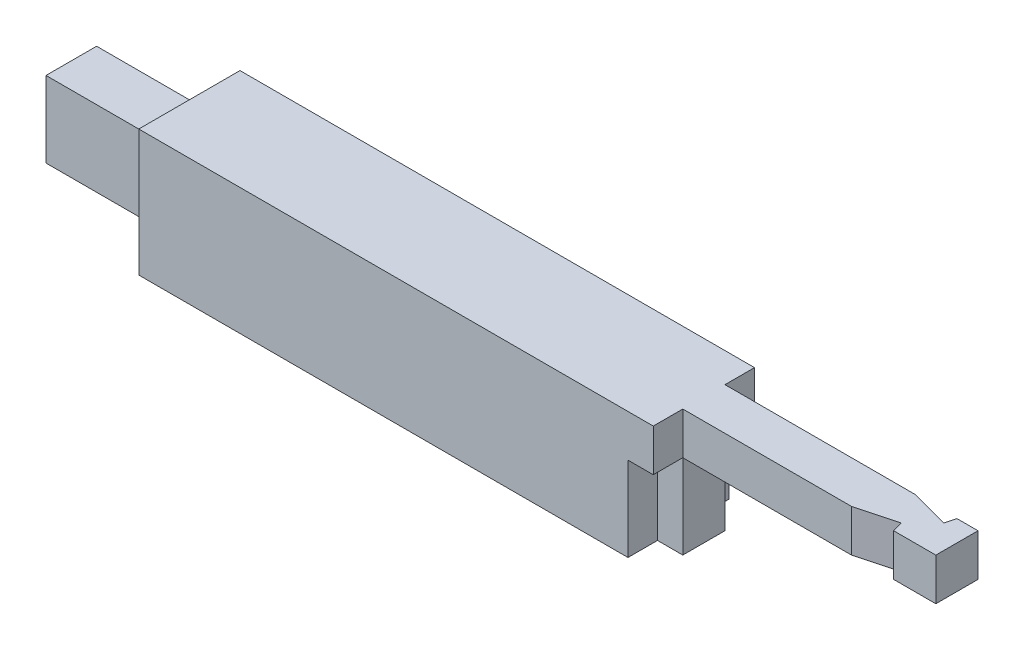
ISO-10303-21;
HEADER;
FILE_DESCRIPTION(('STEP AP214'),'2;1');
FILE_NAME('part.step','',(''),(''),'','','');
FILE_SCHEMA(('AUTOMOTIVE_DESIGN { 1 0 10303 214 1 1 1 1 }'));
ENDSEC;
DATA;
#1=APPLICATION_CONTEXT('core data for automotive mechanical design processes');
#2=APPLICATION_PROTOCOL_DEFINITION('international standard','automotive_design',2000,#1);
#3=PRODUCT_CONTEXT('',#1,'mechanical');
#4=PRODUCT('Part','Part','',(#3));
#5=PRODUCT_RELATED_PRODUCT_CATEGORY('part','',(#4));
#6=PRODUCT_DEFINITION_FORMATION('','',#4);
#7=PRODUCT_DEFINITION_CONTEXT('part definition',#1,'design');
#8=PRODUCT_DEFINITION('design','',#6,#7);
#9=PRODUCT_DEFINITION_SHAPE('','',#8);
#10=(LENGTH_UNIT() NAMED_UNIT(*) SI_UNIT(.MILLI.,.METRE.));
#11=(NAMED_UNIT(*) PLANE_ANGLE_UNIT() SI_UNIT($,.RADIAN.));
#12=(NAMED_UNIT(*) SI_UNIT($,.STERADIAN.) SOLID_ANGLE_UNIT());
#13=UNCERTAINTY_MEASURE_WITH_UNIT(LENGTH_MEASURE(1.E-05),#10,'distance_accuracy_value','');
#14=(GEOMETRIC_REPRESENTATION_CONTEXT(3) GLOBAL_UNCERTAINTY_ASSIGNED_CONTEXT((#13)) GLOBAL_UNIT_ASSIGNED_CONTEXT((#10,
#11,#12)) REPRESENTATION_CONTEXT('',''));
#15=CARTESIAN_POINT('',(0.,0.,0.));
#16=DIRECTION('',(0.,0.,1.));
#17=DIRECTION('',(1.,0.,0.));
#18=AXIS2_PLACEMENT_3D('',#15,#16,#17);
#19=CARTESIAN_POINT('',(610.,150.,0.));
#20=DIRECTION('',(0.,-1.,0.));
#21=DIRECTION('',(0.,0.,-1.));
#22=AXIS2_PLACEMENT_3D('',#19,#20,#21);
#23=PLANE('',#22);
#24=DIRECTION('',(-1.,0.,0.));
#25=VECTOR('',#24,1.);
#26=CARTESIAN_POINT('',(910.,150.,-35.));
#27=LINE('',#26,#25);
#28=CARTESIAN_POINT('',(810.,150.,-35.));
#29=VERTEX_POINT('',#28);
#30=CARTESIAN_POINT('',(610.,150.,-35.));
#31=VERTEX_POINT('',#30);
#32=EDGE_CURVE('E213',#29,#31,#27,.T.);
#33=ORIENTED_EDGE('',*,*,#32,.F.);
#34=DIRECTION('',(-0.965925826289068,0.,0.258819045102522));
#35=VECTOR('',#34,1.);
#36=CARTESIAN_POINT('',(45.5097114673026,150.,169.844555433773));
#37=LINE('',#36,#35);
#38=CARTESIAN_POINT('',(856.650635094611,150.,-47.4999999999999));
#39=VERTEX_POINT('',#38);
#40=EDGE_CURVE('E199',#39,#29,#37,.T.);
#41=ORIENTED_EDGE('',*,*,#40,.F.);
#42=DIRECTION('',(-0.258819045102522,0.,-0.965925826289068));
#43=VECTOR('',#42,1.);
#44=CARTESIAN_POINT('',(811.140923627308,150.,-217.344555433773));
#45=LINE('',#44,#43);
#46=CARTESIAN_POINT('',(860.,150.,-35.));
#47=VERTEX_POINT('',#46);
#48=EDGE_CURVE('E192',#47,#39,#45,.T.);
#49=ORIENTED_EDGE('',*,*,#48,.F.);
#50=CARTESIAN_POINT('',(910.,150.,-35.));
#51=VERTEX_POINT('',#50);
#52=EDGE_CURVE('E205',#51,#47,#27,.T.);
#53=ORIENTED_EDGE('',*,*,#52,.F.);
#54=DIRECTION('',(0.,0.,1.));
#55=VECTOR('',#54,1.);
#56=CARTESIAN_POINT('',(910.,150.,-35.));
#57=LINE('',#56,#55);
#58=CARTESIAN_POINT('',(910.,150.,-85.));
#59=VERTEX_POINT('',#58);
#60=EDGE_CURVE('E217',#59,#51,#57,.T.);
#61=ORIENTED_EDGE('',*,*,#60,.F.);
#62=DIRECTION('',(-1.,0.,0.));
#63=VECTOR('',#62,1.);
#64=CARTESIAN_POINT('',(910.,150.,-85.));
#65=LINE('',#64,#63);
#66=CARTESIAN_POINT('',(885.,150.,-85.));
#67=VERTEX_POINT('',#66);
#68=EDGE_CURVE('E215',#59,#67,#65,.T.);
#69=ORIENTED_EDGE('',*,*,#68,.T.);
#70=DIRECTION('',(-0.258819045102514,0.,0.96592582628907));
#71=VECTOR('',#70,1.);
#72=CARTESIAN_POINT('',(804.466241174617,150.,215.556079660833));
#73=LINE('',#72,#71);
#74=CARTESIAN_POINT('',(881.650635094611,150.,-72.5));
#75=VERTEX_POINT('',#74);
#76=EDGE_CURVE('E59',#67,#75,#73,.T.);
#77=ORIENTED_EDGE('',*,*,#76,.T.);
#78=DIRECTION('',(-0.965925826289068,0.,-0.258819045102521));
#79=VECTOR('',#78,1.);
#80=CARTESIAN_POINT('',(77.184393919997,150.,-288.056079660839));
#81=LINE('',#80,#79);
#82=CARTESIAN_POINT('',(835.,150.,-85.));
#83=VERTEX_POINT('',#82);
#84=EDGE_CURVE('E457',#75,#83,#81,.T.);
#85=ORIENTED_EDGE('',*,*,#84,.T.);
#86=CARTESIAN_POINT('',(610.,150.,-85.));
#87=VERTEX_POINT('',#86);
#88=EDGE_CURVE('E212',#83,#87,#65,.T.);
#89=ORIENTED_EDGE('',*,*,#88,.T.);
#90=DIRECTION('',(0.,0.,1.));
#91=VECTOR('',#90,1.);
#92=CARTESIAN_POINT('',(610.,150.,0.));
#93=LINE('',#92,#91);
#94=CARTESIAN_POINT('',(610.,150.,-120.));
#95=VERTEX_POINT('',#94);
#96=EDGE_CURVE('E241',#95,#87,#93,.T.);
#97=ORIENTED_EDGE('',*,*,#96,.F.);
#98=DIRECTION('',(-1.,0.,0.));
#99=VECTOR('',#98,1.);
#100=CARTESIAN_POINT('',(610.,150.,-120.));
#101=LINE('',#100,#99);
#102=CARTESIAN_POINT('',(0.,150.,-120.));
#103=VERTEX_POINT('',#102);
#104=EDGE_CURVE('E255',#95,#103,#101,.T.);
#105=ORIENTED_EDGE('',*,*,#104,.T.);
#106=DIRECTION('',(0.,0.,1.));
#107=VECTOR('',#106,1.);
#108=CARTESIAN_POINT('',(0.,150.,0.));
#109=LINE('',#108,#107);
#110=CARTESIAN_POINT('',(0.,150.,0.));
#111=VERTEX_POINT('',#110);
#112=EDGE_CURVE('E235',#103,#111,#109,.T.);
#113=ORIENTED_EDGE('',*,*,#112,.T.);
#114=DIRECTION('',(-1.,0.,0.));
#115=VECTOR('',#114,1.);
#116=CARTESIAN_POINT('',(610.,150.,0.));
#117=LINE('',#116,#115);
#118=CARTESIAN_POINT('',(610.,150.,0.));
#119=VERTEX_POINT('',#118);
#120=EDGE_CURVE('E244',#119,#111,#117,.T.);
#121=ORIENTED_EDGE('',*,*,#120,.F.);
#122=EDGE_CURVE('E240',#31,#119,#93,.T.);
#123=ORIENTED_EDGE('',*,*,#122,.F.);
#124=EDGE_LOOP('',(#33,#41,#49,#53,#61,#69,#77,#85,#89,#97,#105,#113,#121,#123));
#125=FACE_BOUND('',#124,.T.);
#126=ADVANCED_FACE('F36',(#125),#23,.F.);
#127=CARTESIAN_POINT('',(910.,150.,-35.));
#128=DIRECTION('',(0.,0.,-1.));
#129=DIRECTION('',(-1.,0.,0.));
#130=AXIS2_PLACEMENT_3D('',#127,#128,#129);
#131=PLANE('',#130);
#132=DIRECTION('',(-1.,0.,0.));
#133=VECTOR('',#132,1.);
#134=CARTESIAN_POINT('',(910.,100.,-35.));
#135=LINE('',#134,#133);
#136=CARTESIAN_POINT('',(810.,100.,-35.));
#137=VERTEX_POINT('',#136);
#138=CARTESIAN_POINT('',(610.,100.,-35.));
#139=VERTEX_POINT('',#138);
#140=EDGE_CURVE('E227',#137,#139,#135,.T.);
#141=ORIENTED_EDGE('',*,*,#140,.F.);
#142=DIRECTION('',(0.,1.,0.));
#143=VECTOR('',#142,1.);
#144=CARTESIAN_POINT('',(810.,0.,-35.));
#145=LINE('',#144,#143);
#146=EDGE_CURVE('E465',#137,#29,#145,.T.);
#147=ORIENTED_EDGE('',*,*,#146,.T.);
#148=ORIENTED_EDGE('',*,*,#32,.T.);
#149=DIRECTION('',(0.,-1.,0.));
#150=VECTOR('',#149,1.);
#151=CARTESIAN_POINT('',(610.,150.,-35.));
#152=LINE('',#151,#150);
#153=EDGE_CURVE('E285',#31,#139,#152,.T.);
#154=ORIENTED_EDGE('',*,*,#153,.T.);
#155=EDGE_LOOP('',(#141,#147,#148,#154));
#156=FACE_BOUND('',#155,.T.);
#157=ADVANCED_FACE('F303',(#156),#131,.F.);
#158=CARTESIAN_POINT('',(910.,100.,-35.));
#159=DIRECTION('',(0.,1.,0.));
#160=DIRECTION('',(0.,0.,1.));
#161=AXIS2_PLACEMENT_3D('',#158,#159,#160);
#162=PLANE('',#161);
#163=DIRECTION('',(-0.258819045102522,0.,-0.965925826289068));
#164=VECTOR('',#163,1.);
#165=CARTESIAN_POINT('',(863.349364905389,100.,-22.4999999999999));
#166=LINE('',#165,#164);
#167=CARTESIAN_POINT('',(860.,100.,-35.));
#168=VERTEX_POINT('',#167);
#169=CARTESIAN_POINT('',(856.650635094611,100.,-47.4999999999999));
#170=VERTEX_POINT('',#169);
#171=EDGE_CURVE('E44',#168,#170,#166,.T.);
#172=ORIENTED_EDGE('',*,*,#171,.T.);
#173=DIRECTION('',(-0.965925826289068,0.,0.258819045102522));
#174=VECTOR('',#173,1.);
#175=CARTESIAN_POINT('',(903.301270189222,100.,-60.0000000000001));
#176=LINE('',#175,#174);
#177=EDGE_CURVE('E11',#170,#137,#176,.T.);
#178=ORIENTED_EDGE('',*,*,#177,.T.);
#179=ORIENTED_EDGE('',*,*,#140,.T.);
#180=DIRECTION('',(0.,0.,-1.));
#181=VECTOR('',#180,1.);
#182=CARTESIAN_POINT('',(610.,100.,-35.));
#183=LINE('',#182,#181);
#184=CARTESIAN_POINT('',(610.,100.,-85.));
#185=VERTEX_POINT('',#184);
#186=EDGE_CURVE('E278',#139,#185,#183,.T.);
#187=ORIENTED_EDGE('',*,*,#186,.T.);
#188=DIRECTION('',(-1.,0.,0.));
#189=VECTOR('',#188,1.);
#190=CARTESIAN_POINT('',(910.,100.,-85.));
#191=LINE('',#190,#189);
#192=CARTESIAN_POINT('',(835.,100.,-85.));
#193=VERTEX_POINT('',#192);
#194=EDGE_CURVE('E223',#193,#185,#191,.T.);
#195=ORIENTED_EDGE('',*,*,#194,.F.);
#196=DIRECTION('',(-0.965925826289068,0.,-0.258819045102521));
#197=VECTOR('',#196,1.);
#198=CARTESIAN_POINT('',(917.475952641916,100.,-62.9006350946109));
#199=LINE('',#198,#197);
#200=CARTESIAN_POINT('',(881.650635094611,100.,-72.5));
#201=VERTEX_POINT('',#200);
#202=EDGE_CURVE('E345',#201,#193,#199,.T.);
#203=ORIENTED_EDGE('',*,*,#202,.F.);
#204=DIRECTION('',(-0.258819045102514,0.,0.96592582628907));
#205=VECTOR('',#204,1.);
#206=CARTESIAN_POINT('',(874.174682452694,100.,-44.5993649053888));
#207=LINE('',#206,#205);
#208=CARTESIAN_POINT('',(885.,100.,-85.));
#209=VERTEX_POINT('',#208);
#210=EDGE_CURVE('E463',#209,#201,#207,.T.);
#211=ORIENTED_EDGE('',*,*,#210,.F.);
#212=CARTESIAN_POINT('',(910.,100.,-85.));
#213=VERTEX_POINT('',#212);
#214=EDGE_CURVE('E224',#213,#209,#191,.T.);
#215=ORIENTED_EDGE('',*,*,#214,.F.);
#216=DIRECTION('',(0.,0.,-1.));
#217=VECTOR('',#216,1.);
#218=CARTESIAN_POINT('',(910.,100.,-35.));
#219=LINE('',#218,#217);
#220=CARTESIAN_POINT('',(910.,100.,-35.));
#221=VERTEX_POINT('',#220);
#222=EDGE_CURVE('E269',#221,#213,#219,.T.);
#223=ORIENTED_EDGE('',*,*,#222,.F.);
#224=EDGE_CURVE('E228',#221,#168,#135,.T.);
#225=ORIENTED_EDGE('',*,*,#224,.T.);
#226=EDGE_LOOP('',(#172,#178,#179,#187,#195,#203,#211,#215,#223,#225));
#227=FACE_BOUND('',#226,.T.);
#228=ADVANCED_FACE('F266',(#227),#162,.F.);
#229=CARTESIAN_POINT('',(910.,150.,-85.));
#230=DIRECTION('',(0.,0.,1.));
#231=DIRECTION('',(1.,0.,0.));
#232=AXIS2_PLACEMENT_3D('',#229,#230,#231);
#233=PLANE('',#232);
#234=DIRECTION('',(0.,1.,0.));
#235=VECTOR('',#234,1.);
#236=CARTESIAN_POINT('',(835.,150.,-85.));
#237=LINE('',#236,#235);
#238=EDGE_CURVE('E264',#193,#83,#237,.T.);
#239=ORIENTED_EDGE('',*,*,#238,.F.);
#240=ORIENTED_EDGE('',*,*,#194,.T.);
#241=DIRECTION('',(0.,1.,0.));
#242=VECTOR('',#241,1.);
#243=CARTESIAN_POINT('',(610.,150.,-85.));
#244=LINE('',#243,#242);
#245=EDGE_CURVE('E219',#185,#87,#244,.T.);
#246=ORIENTED_EDGE('',*,*,#245,.T.);
#247=ORIENTED_EDGE('',*,*,#88,.F.);
#248=EDGE_LOOP('',(#239,#240,#246,#247));
#249=FACE_BOUND('',#248,.T.);
#250=ADVANCED_FACE('F451',(#249),#233,.F.);
#251=DIRECTION('',(0.,-1.,0.));
#252=VECTOR('',#251,1.);
#253=CARTESIAN_POINT('',(885.,150.,-85.));
#254=LINE('',#253,#252);
#255=EDGE_CURVE('E262',#67,#209,#254,.T.);
#256=ORIENTED_EDGE('',*,*,#255,.F.);
#257=ORIENTED_EDGE('',*,*,#68,.F.);
#258=DIRECTION('',(0.,1.,0.));
#259=VECTOR('',#258,1.);
#260=CARTESIAN_POINT('',(910.,150.,-85.));
#261=LINE('',#260,#259);
#262=EDGE_CURVE('E273',#213,#59,#261,.T.);
#263=ORIENTED_EDGE('',*,*,#262,.F.);
#264=ORIENTED_EDGE('',*,*,#214,.T.);
#265=EDGE_LOOP('',(#256,#257,#263,#264));
#266=FACE_BOUND('',#265,.T.);
#267=ADVANCED_FACE('F491',(#266),#233,.F.);
#268=CARTESIAN_POINT('',(610.,0.,0.));
#269=DIRECTION('',(-1.,0.,0.));
#270=DIRECTION('',(0.,0.,1.));
#271=AXIS2_PLACEMENT_3D('',#268,#269,#270);
#272=PLANE('',#271);
#273=ORIENTED_EDGE('',*,*,#186,.F.);
#274=DIRECTION('',(0.,1.,0.));
#275=VECTOR('',#274,1.);
#276=CARTESIAN_POINT('',(610.,100.,-35.));
#277=LINE('',#276,#275);
#278=CARTESIAN_POINT('',(610.,0.,-35.));
#279=VERTEX_POINT('',#278);
#280=EDGE_CURVE('E297',#279,#139,#277,.T.);
#281=ORIENTED_EDGE('',*,*,#280,.F.);
#282=DIRECTION('',(0.,0.,-1.));
#283=VECTOR('',#282,1.);
#284=CARTESIAN_POINT('',(610.,0.,0.));
#285=LINE('',#284,#283);
#286=CARTESIAN_POINT('',(610.,0.,-85.));
#287=VERTEX_POINT('',#286);
#288=EDGE_CURVE('E234',#279,#287,#285,.T.);
#289=ORIENTED_EDGE('',*,*,#288,.T.);
#290=DIRECTION('',(0.,-1.,0.));
#291=VECTOR('',#290,1.);
#292=CARTESIAN_POINT('',(610.,100.,-85.));
#293=LINE('',#292,#291);
#294=EDGE_CURVE('E299',#185,#287,#293,.T.);
#295=ORIENTED_EDGE('',*,*,#294,.F.);
#296=EDGE_LOOP('',(#273,#281,#289,#295));
#297=FACE_BOUND('',#296,.T.);
#298=ADVANCED_FACE('F295',(#297),#272,.F.);
#299=DIRECTION('',(0.,-1.,0.));
#300=VECTOR('',#299,1.);
#301=CARTESIAN_POINT('',(610.,0.,0.));
#302=LINE('',#301,#300);
#303=CARTESIAN_POINT('',(610.,100.,0.));
#304=VERTEX_POINT('',#303);
#305=EDGE_CURVE('E231',#119,#304,#302,.T.);
#306=ORIENTED_EDGE('',*,*,#305,.T.);
#307=DIRECTION('',(0.,0.,1.));
#308=VECTOR('',#307,1.);
#309=CARTESIAN_POINT('',(610.,100.,-35.));
#310=LINE('',#309,#308);
#311=EDGE_CURVE('E310',#139,#304,#310,.T.);
#312=ORIENTED_EDGE('',*,*,#311,.F.);
#313=ORIENTED_EDGE('',*,*,#153,.F.);
#314=ORIENTED_EDGE('',*,*,#122,.T.);
#315=EDGE_LOOP('',(#306,#312,#313,#314));
#316=FACE_BOUND('',#315,.T.);
#317=ADVANCED_FACE('F308',(#316),#272,.F.);
#318=CARTESIAN_POINT('',(0.,0.,0.));
#319=DIRECTION('',(-1.,0.,0.));
#320=DIRECTION('',(0.,0.,1.));
#321=AXIS2_PLACEMENT_3D('',#318,#319,#320);
#322=PLANE('',#321);
#323=DIRECTION('',(0.,-1.,0.));
#324=VECTOR('',#323,1.);
#325=CARTESIAN_POINT('',(0.,0.,0.));
#326=LINE('',#325,#324);
#327=CARTESIAN_POINT('',(0.,0.,0.));
#328=VERTEX_POINT('',#327);
#329=EDGE_CURVE('E230',#111,#328,#326,.T.);
#330=ORIENTED_EDGE('',*,*,#329,.F.);
#331=ORIENTED_EDGE('',*,*,#112,.F.);
#332=DIRECTION('',(0.,1.,0.));
#333=VECTOR('',#332,1.);
#334=CARTESIAN_POINT('',(0.,0.,-120.));
#335=LINE('',#334,#333);
#336=CARTESIAN_POINT('',(0.,0.,-120.));
#337=VERTEX_POINT('',#336);
#338=EDGE_CURVE('E250',#337,#103,#335,.T.);
#339=ORIENTED_EDGE('',*,*,#338,.F.);
#340=DIRECTION('',(0.,0.,-1.));
#341=VECTOR('',#340,1.);
#342=CARTESIAN_POINT('',(0.,0.,0.));
#343=LINE('',#342,#341);
#344=EDGE_CURVE('E247',#328,#337,#343,.T.);
#345=ORIENTED_EDGE('',*,*,#344,.F.);
#346=EDGE_LOOP('',(#330,#331,#339,#345));
#347=FACE_BOUND('',#346,.T.);
#348=DIRECTION('',(0.,0.,1.));
#349=VECTOR('',#348,1.);
#350=CARTESIAN_POINT('',(0.,30.,0.));
#351=LINE('',#350,#349);
#352=CARTESIAN_POINT('',(0.,30.,-90.));
#353=VERTEX_POINT('',#352);
#354=CARTESIAN_POINT('',(0.,30.,-30.));
#355=VERTEX_POINT('',#354);
#356=EDGE_CURVE('E368',#353,#355,#351,.T.);
#357=ORIENTED_EDGE('',*,*,#356,.F.);
#358=DIRECTION('',(0.,1.,0.));
#359=VECTOR('',#358,1.);
#360=CARTESIAN_POINT('',(0.,0.,-90.));
#361=LINE('',#360,#359);
#362=CARTESIAN_POINT('',(0.,120.,-90.));
#363=VERTEX_POINT('',#362);
#364=EDGE_CURVE('E326',#353,#363,#361,.T.);
#365=ORIENTED_EDGE('',*,*,#364,.T.);
#366=DIRECTION('',(0.,0.,1.));
#367=VECTOR('',#366,1.);
#368=CARTESIAN_POINT('',(0.,120.,0.));
#369=LINE('',#368,#367);
#370=CARTESIAN_POINT('',(0.,120.,-30.));
#371=VERTEX_POINT('',#370);
#372=EDGE_CURVE('E359',#363,#371,#369,.T.);
#373=ORIENTED_EDGE('',*,*,#372,.T.);
#374=DIRECTION('',(0.,1.,0.));
#375=VECTOR('',#374,1.);
#376=CARTESIAN_POINT('',(0.,0.,-30.));
#377=LINE('',#376,#375);
#378=EDGE_CURVE('E371',#355,#371,#377,.T.);
#379=ORIENTED_EDGE('',*,*,#378,.F.);
#380=EDGE_LOOP('',(#357,#365,#373,#379));
#381=FACE_BOUND('',#380,.T.);
#382=ADVANCED_FACE('F394',(#347,#381),#322,.T.);
#383=ORIENTED_EDGE('',*,*,#245,.F.);
#384=DIRECTION('',(0.,0.,1.));
#385=VECTOR('',#384,1.);
#386=CARTESIAN_POINT('',(610.,100.,-85.));
#387=LINE('',#386,#385);
#388=CARTESIAN_POINT('',(610.,100.,-120.));
#389=VERTEX_POINT('',#388);
#390=EDGE_CURVE('E336',#389,#185,#387,.T.);
#391=ORIENTED_EDGE('',*,*,#390,.F.);
#392=DIRECTION('',(0.,1.,0.));
#393=VECTOR('',#392,1.);
#394=CARTESIAN_POINT('',(610.,0.,-120.));
#395=LINE('',#394,#393);
#396=EDGE_CURVE('E238',#389,#95,#395,.T.);
#397=ORIENTED_EDGE('',*,*,#396,.T.);
#398=ORIENTED_EDGE('',*,*,#96,.T.);
#399=EDGE_LOOP('',(#383,#391,#397,#398));
#400=FACE_BOUND('',#399,.T.);
#401=ADVANCED_FACE('F431',(#400),#272,.F.);
#402=CARTESIAN_POINT('',(610.,0.,0.));
#403=DIRECTION('',(0.,0.,-1.));
#404=DIRECTION('',(-1.,0.,0.));
#405=AXIS2_PLACEMENT_3D('',#402,#403,#404);
#406=PLANE('',#405);
#407=DIRECTION('',(0.,-1.,0.));
#408=VECTOR('',#407,1.);
#409=CARTESIAN_POINT('',(580.,100.,0.));
#410=LINE('',#409,#408);
#411=CARTESIAN_POINT('',(580.,100.,0.));
#412=VERTEX_POINT('',#411);
#413=CARTESIAN_POINT('',(580.,0.,0.));
#414=VERTEX_POINT('',#413);
#415=EDGE_CURVE('E319',#412,#414,#410,.T.);
#416=ORIENTED_EDGE('',*,*,#415,.F.);
#417=DIRECTION('',(1.,0.,0.));
#418=VECTOR('',#417,1.);
#419=CARTESIAN_POINT('',(580.,100.,0.));
#420=LINE('',#419,#418);
#421=EDGE_CURVE('E317',#412,#304,#420,.T.);
#422=ORIENTED_EDGE('',*,*,#421,.T.);
#423=ORIENTED_EDGE('',*,*,#305,.F.);
#424=ORIENTED_EDGE('',*,*,#120,.T.);
#425=ORIENTED_EDGE('',*,*,#329,.T.);
#426=DIRECTION('',(-1.,0.,0.));
#427=VECTOR('',#426,1.);
#428=CARTESIAN_POINT('',(610.,0.,0.));
#429=LINE('',#428,#427);
#430=EDGE_CURVE('E260',#414,#328,#429,.T.);
#431=ORIENTED_EDGE('',*,*,#430,.F.);
#432=EDGE_LOOP('',(#416,#422,#423,#424,#425,#431));
#433=FACE_BOUND('',#432,.T.);
#434=ADVANCED_FACE('F38',(#433),#406,.F.);
#435=CARTESIAN_POINT('',(610.,0.,0.));
#436=DIRECTION('',(0.,1.,0.));
#437=DIRECTION('',(0.,0.,1.));
#438=AXIS2_PLACEMENT_3D('',#435,#436,#437);
#439=PLANE('',#438);
#440=ORIENTED_EDGE('',*,*,#288,.F.);
#441=DIRECTION('',(1.,0.,0.));
#442=VECTOR('',#441,1.);
#443=CARTESIAN_POINT('',(580.,0.,-35.));
#444=LINE('',#443,#442);
#445=CARTESIAN_POINT('',(580.,0.,-35.));
#446=VERTEX_POINT('',#445);
#447=EDGE_CURVE('E323',#446,#279,#444,.T.);
#448=ORIENTED_EDGE('',*,*,#447,.F.);
#449=DIRECTION('',(0.,0.,-1.));
#450=VECTOR('',#449,1.);
#451=CARTESIAN_POINT('',(580.,0.,-35.));
#452=LINE('',#451,#450);
#453=EDGE_CURVE('E328',#414,#446,#452,.T.);
#454=ORIENTED_EDGE('',*,*,#453,.F.);
#455=ORIENTED_EDGE('',*,*,#430,.T.);
#456=ORIENTED_EDGE('',*,*,#344,.T.);
#457=DIRECTION('',(-1.,0.,0.));
#458=VECTOR('',#457,1.);
#459=CARTESIAN_POINT('',(610.,0.,-120.));
#460=LINE('',#459,#458);
#461=CARTESIAN_POINT('',(580.,0.,-120.));
#462=VERTEX_POINT('',#461);
#463=EDGE_CURVE('E258',#462,#337,#460,.T.);
#464=ORIENTED_EDGE('',*,*,#463,.F.);
#465=DIRECTION('',(0.,0.,-1.));
#466=VECTOR('',#465,1.);
#467=CARTESIAN_POINT('',(580.,0.,-85.));
#468=LINE('',#467,#466);
#469=CARTESIAN_POINT('',(580.,0.,-85.));
#470=VERTEX_POINT('',#469);
#471=EDGE_CURVE('E335',#470,#462,#468,.T.);
#472=ORIENTED_EDGE('',*,*,#471,.F.);
#473=DIRECTION('',(1.,0.,0.));
#474=VECTOR('',#473,1.);
#475=CARTESIAN_POINT('',(580.,0.,-85.));
#476=LINE('',#475,#474);
#477=EDGE_CURVE('E343',#470,#287,#476,.T.);
#478=ORIENTED_EDGE('',*,*,#477,.T.);
#479=EDGE_LOOP('',(#440,#448,#454,#455,#456,#464,#472,#478));
#480=FACE_BOUND('',#479,.T.);
#481=ADVANCED_FACE('F424',(#480),#439,.F.);
#482=CARTESIAN_POINT('',(610.,0.,-120.));
#483=DIRECTION('',(0.,0.,1.));
#484=DIRECTION('',(1.,0.,0.));
#485=AXIS2_PLACEMENT_3D('',#482,#483,#484);
#486=PLANE('',#485);
#487=ORIENTED_EDGE('',*,*,#396,.F.);
#488=DIRECTION('',(1.,0.,0.));
#489=VECTOR('',#488,1.);
#490=CARTESIAN_POINT('',(580.,100.,-120.));
#491=LINE('',#490,#489);
#492=CARTESIAN_POINT('',(580.,100.,-120.));
#493=VERTEX_POINT('',#492);
#494=EDGE_CURVE('E351',#493,#389,#491,.T.);
#495=ORIENTED_EDGE('',*,*,#494,.F.);
#496=DIRECTION('',(0.,1.,0.));
#497=VECTOR('',#496,1.);
#498=CARTESIAN_POINT('',(580.,100.,-120.));
#499=LINE('',#498,#497);
#500=EDGE_CURVE('E338',#462,#493,#499,.T.);
#501=ORIENTED_EDGE('',*,*,#500,.F.);
#502=ORIENTED_EDGE('',*,*,#463,.T.);
#503=ORIENTED_EDGE('',*,*,#338,.T.);
#504=ORIENTED_EDGE('',*,*,#104,.F.);
#505=EDGE_LOOP('',(#487,#495,#501,#502,#503,#504));
#506=FACE_BOUND('',#505,.T.);
#507=ADVANCED_FACE('F422',(#506),#486,.F.);
#508=ORIENTED_EDGE('',*,*,#52,.T.);
#509=DIRECTION('',(0.,1.,0.));
#510=VECTOR('',#509,1.);
#511=CARTESIAN_POINT('',(860.,0.,-35.));
#512=LINE('',#511,#510);
#513=EDGE_CURVE('E189',#168,#47,#512,.T.);
#514=ORIENTED_EDGE('',*,*,#513,.F.);
#515=ORIENTED_EDGE('',*,*,#224,.F.);
#516=DIRECTION('',(0.,-1.,0.));
#517=VECTOR('',#516,1.);
#518=CARTESIAN_POINT('',(910.,150.,-35.));
#519=LINE('',#518,#517);
#520=EDGE_CURVE('E211',#51,#221,#519,.T.);
#521=ORIENTED_EDGE('',*,*,#520,.F.);
#522=EDGE_LOOP('',(#508,#514,#515,#521));
#523=FACE_BOUND('',#522,.T.);
#524=ADVANCED_FACE('F209',(#523),#131,.F.);
#525=CARTESIAN_POINT('',(910.,0.,0.));
#526=DIRECTION('',(1.,0.,0.));
#527=DIRECTION('',(0.,0.,-1.));
#528=AXIS2_PLACEMENT_3D('',#525,#526,#527);
#529=PLANE('',#528);
#530=ORIENTED_EDGE('',*,*,#520,.T.);
#531=ORIENTED_EDGE('',*,*,#222,.T.);
#532=ORIENTED_EDGE('',*,*,#262,.T.);
#533=ORIENTED_EDGE('',*,*,#60,.T.);
#534=EDGE_LOOP('',(#530,#531,#532,#533));
#535=FACE_BOUND('',#534,.T.);
#536=ADVANCED_FACE('F275',(#535),#529,.T.);
#537=CARTESIAN_POINT('',(-140.,0.,-90.));
#538=DIRECTION('',(0.,0.,-1.));
#539=DIRECTION('',(-1.,0.,0.));
#540=AXIS2_PLACEMENT_3D('',#537,#538,#539);
#541=PLANE('',#540);
#542=ORIENTED_EDGE('',*,*,#364,.F.);
#543=DIRECTION('',(1.,0.,0.));
#544=VECTOR('',#543,1.);
#545=CARTESIAN_POINT('',(-140.,30.,-90.));
#546=LINE('',#545,#544);
#547=CARTESIAN_POINT('',(-140.,30.,-90.));
#548=VERTEX_POINT('',#547);
#549=EDGE_CURVE('E280',#548,#353,#546,.T.);
#550=ORIENTED_EDGE('',*,*,#549,.F.);
#551=DIRECTION('',(0.,1.,0.));
#552=VECTOR('',#551,1.);
#553=CARTESIAN_POINT('',(-140.,0.,-90.));
#554=LINE('',#553,#552);
#555=CARTESIAN_POINT('',(-140.,120.,-90.));
#556=VERTEX_POINT('',#555);
#557=EDGE_CURVE('E355',#548,#556,#554,.T.);
#558=ORIENTED_EDGE('',*,*,#557,.T.);
#559=DIRECTION('',(1.,0.,0.));
#560=VECTOR('',#559,1.);
#561=CARTESIAN_POINT('',(-140.,120.,-90.));
#562=LINE('',#561,#560);
#563=EDGE_CURVE('E366',#556,#363,#562,.T.);
#564=ORIENTED_EDGE('',*,*,#563,.T.);
#565=EDGE_LOOP('',(#542,#550,#558,#564));
#566=FACE_BOUND('',#565,.T.);
#567=ADVANCED_FACE('F391',(#566),#541,.T.);
#568=CARTESIAN_POINT('',(-140.,30.,0.));
#569=DIRECTION('',(0.,1.,0.));
#570=DIRECTION('',(0.,0.,1.));
#571=AXIS2_PLACEMENT_3D('',#568,#569,#570);
#572=PLANE('',#571);
#573=ORIENTED_EDGE('',*,*,#356,.T.);
#574=DIRECTION('',(1.,0.,0.));
#575=VECTOR('',#574,1.);
#576=CARTESIAN_POINT('',(-140.,30.,-30.));
#577=LINE('',#576,#575);
#578=CARTESIAN_POINT('',(-140.,30.,-30.));
#579=VERTEX_POINT('',#578);
#580=EDGE_CURVE('E379',#579,#355,#577,.T.);
#581=ORIENTED_EDGE('',*,*,#580,.F.);
#582=DIRECTION('',(0.,0.,1.));
#583=VECTOR('',#582,1.);
#584=CARTESIAN_POINT('',(-140.,30.,0.));
#585=LINE('',#584,#583);
#586=EDGE_CURVE('E358',#548,#579,#585,.T.);
#587=ORIENTED_EDGE('',*,*,#586,.F.);
#588=ORIENTED_EDGE('',*,*,#549,.T.);
#589=EDGE_LOOP('',(#573,#581,#587,#588));
#590=FACE_BOUND('',#589,.T.);
#591=ADVANCED_FACE('F388',(#590),#572,.F.);
#592=CARTESIAN_POINT('',(-140.,0.,-30.));
#593=DIRECTION('',(0.,0.,-1.));
#594=DIRECTION('',(-1.,0.,0.));
#595=AXIS2_PLACEMENT_3D('',#592,#593,#594);
#596=PLANE('',#595);
#597=ORIENTED_EDGE('',*,*,#378,.T.);
#598=DIRECTION('',(1.,0.,0.));
#599=VECTOR('',#598,1.);
#600=CARTESIAN_POINT('',(-140.,120.,-30.));
#601=LINE('',#600,#599);
#602=CARTESIAN_POINT('',(-140.,120.,-30.));
#603=VERTEX_POINT('',#602);
#604=EDGE_CURVE('E377',#603,#371,#601,.T.);
#605=ORIENTED_EDGE('',*,*,#604,.F.);
#606=DIRECTION('',(0.,1.,0.));
#607=VECTOR('',#606,1.);
#608=CARTESIAN_POINT('',(-140.,0.,-30.));
#609=LINE('',#608,#607);
#610=EDGE_CURVE('E361',#579,#603,#609,.T.);
#611=ORIENTED_EDGE('',*,*,#610,.F.);
#612=ORIENTED_EDGE('',*,*,#580,.T.);
#613=EDGE_LOOP('',(#597,#605,#611,#612));
#614=FACE_BOUND('',#613,.T.);
#615=ADVANCED_FACE('F396',(#614),#596,.F.);
#616=CARTESIAN_POINT('',(-140.,120.,0.));
#617=DIRECTION('',(0.,1.,0.));
#618=DIRECTION('',(0.,0.,1.));
#619=AXIS2_PLACEMENT_3D('',#616,#617,#618);
#620=PLANE('',#619);
#621=ORIENTED_EDGE('',*,*,#372,.F.);
#622=ORIENTED_EDGE('',*,*,#563,.F.);
#623=DIRECTION('',(0.,0.,1.));
#624=VECTOR('',#623,1.);
#625=CARTESIAN_POINT('',(-140.,120.,0.));
#626=LINE('',#625,#624);
#627=EDGE_CURVE('E363',#556,#603,#626,.T.);
#628=ORIENTED_EDGE('',*,*,#627,.T.);
#629=ORIENTED_EDGE('',*,*,#604,.T.);
#630=EDGE_LOOP('',(#621,#622,#628,#629));
#631=FACE_BOUND('',#630,.T.);
#632=ADVANCED_FACE('F399',(#631),#620,.T.);
#633=CARTESIAN_POINT('',(-140.,0.,0.));
#634=DIRECTION('',(-1.,0.,0.));
#635=DIRECTION('',(0.,0.,1.));
#636=AXIS2_PLACEMENT_3D('',#633,#634,#635);
#637=PLANE('',#636);
#638=ORIENTED_EDGE('',*,*,#557,.F.);
#639=ORIENTED_EDGE('',*,*,#586,.T.);
#640=ORIENTED_EDGE('',*,*,#610,.T.);
#641=ORIENTED_EDGE('',*,*,#627,.F.);
#642=EDGE_LOOP('',(#638,#639,#640,#641));
#643=FACE_BOUND('',#642,.T.);
#644=ADVANCED_FACE('F401',(#643),#637,.T.);
#645=CARTESIAN_POINT('',(580.,100.,-85.));
#646=DIRECTION('',(0.,0.,1.));
#647=DIRECTION('',(1.,0.,0.));
#648=AXIS2_PLACEMENT_3D('',#645,#646,#647);
#649=PLANE('',#648);
#650=ORIENTED_EDGE('',*,*,#294,.T.);
#651=ORIENTED_EDGE('',*,*,#477,.F.);
#652=DIRECTION('',(0.,-1.,0.));
#653=VECTOR('',#652,1.);
#654=CARTESIAN_POINT('',(580.,100.,-85.));
#655=LINE('',#654,#653);
#656=CARTESIAN_POINT('',(580.,100.,-85.));
#657=VERTEX_POINT('',#656);
#658=EDGE_CURVE('E332',#657,#470,#655,.T.);
#659=ORIENTED_EDGE('',*,*,#658,.F.);
#660=DIRECTION('',(1.,0.,0.));
#661=VECTOR('',#660,1.);
#662=CARTESIAN_POINT('',(580.,100.,-85.));
#663=LINE('',#662,#661);
#664=EDGE_CURVE('E348',#657,#185,#663,.T.);
#665=ORIENTED_EDGE('',*,*,#664,.T.);
#666=EDGE_LOOP('',(#650,#651,#659,#665));
#667=FACE_BOUND('',#666,.T.);
#668=ADVANCED_FACE('F403',(#667),#649,.F.);
#669=CARTESIAN_POINT('',(580.,100.,-85.));
#670=DIRECTION('',(0.,1.,0.));
#671=DIRECTION('',(0.,0.,1.));
#672=AXIS2_PLACEMENT_3D('',#669,#670,#671);
#673=PLANE('',#672);
#674=ORIENTED_EDGE('',*,*,#390,.T.);
#675=ORIENTED_EDGE('',*,*,#664,.F.);
#676=DIRECTION('',(0.,0.,1.));
#677=VECTOR('',#676,1.);
#678=CARTESIAN_POINT('',(580.,100.,-85.));
#679=LINE('',#678,#677);
#680=EDGE_CURVE('E340',#493,#657,#679,.T.);
#681=ORIENTED_EDGE('',*,*,#680,.F.);
#682=ORIENTED_EDGE('',*,*,#494,.T.);
#683=EDGE_LOOP('',(#674,#675,#681,#682));
#684=FACE_BOUND('',#683,.T.);
#685=ADVANCED_FACE('F409',(#684),#673,.F.);
#686=CARTESIAN_POINT('',(580.,0.,0.));
#687=DIRECTION('',(1.,0.,0.));
#688=DIRECTION('',(0.,0.,-1.));
#689=AXIS2_PLACEMENT_3D('',#686,#687,#688);
#690=PLANE('',#689);
#691=ORIENTED_EDGE('',*,*,#658,.T.);
#692=ORIENTED_EDGE('',*,*,#471,.T.);
#693=ORIENTED_EDGE('',*,*,#500,.T.);
#694=ORIENTED_EDGE('',*,*,#680,.T.);
#695=EDGE_LOOP('',(#691,#692,#693,#694));
#696=FACE_BOUND('',#695,.T.);
#697=ADVANCED_FACE('F438',(#696),#690,.T.);
#698=CARTESIAN_POINT('',(580.,100.,-35.));
#699=DIRECTION('',(0.,0.,-1.));
#700=DIRECTION('',(-1.,0.,0.));
#701=AXIS2_PLACEMENT_3D('',#698,#699,#700);
#702=PLANE('',#701);
#703=ORIENTED_EDGE('',*,*,#280,.T.);
#704=DIRECTION('',(1.,0.,0.));
#705=VECTOR('',#704,1.);
#706=CARTESIAN_POINT('',(580.,100.,-35.));
#707=LINE('',#706,#705);
#708=CARTESIAN_POINT('',(580.,100.,-35.));
#709=VERTEX_POINT('',#708);
#710=EDGE_CURVE('E324',#709,#139,#707,.T.);
#711=ORIENTED_EDGE('',*,*,#710,.F.);
#712=DIRECTION('',(0.,1.,0.));
#713=VECTOR('',#712,1.);
#714=CARTESIAN_POINT('',(580.,100.,-35.));
#715=LINE('',#714,#713);
#716=EDGE_CURVE('E467',#446,#709,#715,.T.);
#717=ORIENTED_EDGE('',*,*,#716,.F.);
#718=ORIENTED_EDGE('',*,*,#447,.T.);
#719=EDGE_LOOP('',(#703,#711,#717,#718));
#720=FACE_BOUND('',#719,.T.);
#721=ADVANCED_FACE('F477',(#720),#702,.F.);
#722=CARTESIAN_POINT('',(580.,100.,-35.));
#723=DIRECTION('',(0.,1.,0.));
#724=DIRECTION('',(0.,0.,1.));
#725=AXIS2_PLACEMENT_3D('',#722,#723,#724);
#726=PLANE('',#725);
#727=ORIENTED_EDGE('',*,*,#311,.T.);
#728=ORIENTED_EDGE('',*,*,#421,.F.);
#729=DIRECTION('',(0.,0.,1.));
#730=VECTOR('',#729,1.);
#731=CARTESIAN_POINT('',(580.,100.,-35.));
#732=LINE('',#731,#730);
#733=EDGE_CURVE('E470',#709,#412,#732,.T.);
#734=ORIENTED_EDGE('',*,*,#733,.F.);
#735=ORIENTED_EDGE('',*,*,#710,.T.);
#736=EDGE_LOOP('',(#727,#728,#734,#735));
#737=FACE_BOUND('',#736,.T.);
#738=ADVANCED_FACE('F475',(#737),#726,.F.);
#739=CARTESIAN_POINT('',(580.,0.,0.));
#740=DIRECTION('',(-1.,0.,0.));
#741=DIRECTION('',(0.,0.,1.));
#742=AXIS2_PLACEMENT_3D('',#739,#740,#741);
#743=PLANE('',#742);
#744=ORIENTED_EDGE('',*,*,#716,.T.);
#745=ORIENTED_EDGE('',*,*,#733,.T.);
#746=ORIENTED_EDGE('',*,*,#415,.T.);
#747=ORIENTED_EDGE('',*,*,#453,.T.);
#748=EDGE_LOOP('',(#744,#745,#746,#747));
#749=FACE_BOUND('',#748,.T.);
#750=ADVANCED_FACE('F479',(#749),#743,.F.);
#751=CARTESIAN_POINT('',(77.184393919997,0.,-288.056079660839));
#752=DIRECTION('',(0.258819045102521,0.,-0.965925826289068));
#753=DIRECTION('',(-0.965925826289068,0.,-0.258819045102521));
#754=AXIS2_PLACEMENT_3D('',#751,#752,#753);
#755=PLANE('',#754);
#756=ORIENTED_EDGE('',*,*,#202,.T.);
#757=ORIENTED_EDGE('',*,*,#238,.T.);
#758=ORIENTED_EDGE('',*,*,#84,.F.);
#759=DIRECTION('',(0.,1.,0.));
#760=VECTOR('',#759,1.);
#761=CARTESIAN_POINT('',(881.650635094611,0.,-72.5));
#762=LINE('',#761,#760);
#763=EDGE_CURVE('E207',#201,#75,#762,.T.);
#764=ORIENTED_EDGE('',*,*,#763,.F.);
#765=EDGE_LOOP('',(#756,#757,#758,#764));
#766=FACE_BOUND('',#765,.T.);
#767=ADVANCED_FACE('F455',(#766),#755,.T.);
#768=CARTESIAN_POINT('',(804.466241174617,0.,215.556079660833));
#769=DIRECTION('',(-0.96592582628907,0.,-0.258819045102514));
#770=DIRECTION('',(-0.258819045102514,0.,0.96592582628907));
#771=AXIS2_PLACEMENT_3D('',#768,#769,#770);
#772=PLANE('',#771);
#773=ORIENTED_EDGE('',*,*,#210,.T.);
#774=ORIENTED_EDGE('',*,*,#763,.T.);
#775=ORIENTED_EDGE('',*,*,#76,.F.);
#776=ORIENTED_EDGE('',*,*,#255,.T.);
#777=EDGE_LOOP('',(#773,#774,#775,#776));
#778=FACE_BOUND('',#777,.T.);
#779=ADVANCED_FACE('F642',(#778),#772,.T.);
#780=CARTESIAN_POINT('',(45.5097114673026,0.,169.844555433773));
#781=DIRECTION('',(-0.258819045102522,0.,-0.965925826289068));
#782=DIRECTION('',(-0.965925826289068,0.,0.258819045102522));
#783=AXIS2_PLACEMENT_3D('',#780,#781,#782);
#784=PLANE('',#783);
#785=DIRECTION('',(0.,1.,0.));
#786=VECTOR('',#785,1.);
#787=CARTESIAN_POINT('',(856.650635094611,0.,-47.4999999999999));
#788=LINE('',#787,#786);
#789=EDGE_CURVE('E51',#170,#39,#788,.T.);
#790=ORIENTED_EDGE('',*,*,#789,.T.);
#791=ORIENTED_EDGE('',*,*,#40,.T.);
#792=ORIENTED_EDGE('',*,*,#146,.F.);
#793=ORIENTED_EDGE('',*,*,#177,.F.);
#794=EDGE_LOOP('',(#790,#791,#792,#793));
#795=FACE_BOUND('',#794,.T.);
#796=ADVANCED_FACE('F651',(#795),#784,.F.);
#797=CARTESIAN_POINT('',(811.140923627308,0.,-217.344555433773));
#798=DIRECTION('',(0.965925826289068,0.,-0.258819045102522));
#799=DIRECTION('',(-0.258819045102522,0.,-0.965925826289068));
#800=AXIS2_PLACEMENT_3D('',#797,#798,#799);
#801=PLANE('',#800);
#802=ORIENTED_EDGE('',*,*,#513,.T.);
#803=ORIENTED_EDGE('',*,*,#48,.T.);
#804=ORIENTED_EDGE('',*,*,#789,.F.);
#805=ORIENTED_EDGE('',*,*,#171,.F.);
#806=EDGE_LOOP('',(#802,#803,#804,#805));
#807=FACE_BOUND('',#806,.T.);
#808=ADVANCED_FACE('F191',(#807),#801,.F.);
#809=CLOSED_SHELL('',(#126,#157,#228,#250,#267,#298,#317,#382,#401,#434,#481,#507,#524,#536,
#567,#591,#615,#632,#644,#668,#685,#697,#721,#738,#750,#767,#779,#796,#808));
#810=MANIFOLD_SOLID_BREP('B2',#809);
#811=ADVANCED_BREP_SHAPE_REPRESENTATION('',(#18,#810),#14);
#812=SHAPE_DEFINITION_REPRESENTATION(#9,#811);
ENDSEC;
END-ISO-10303-21;
